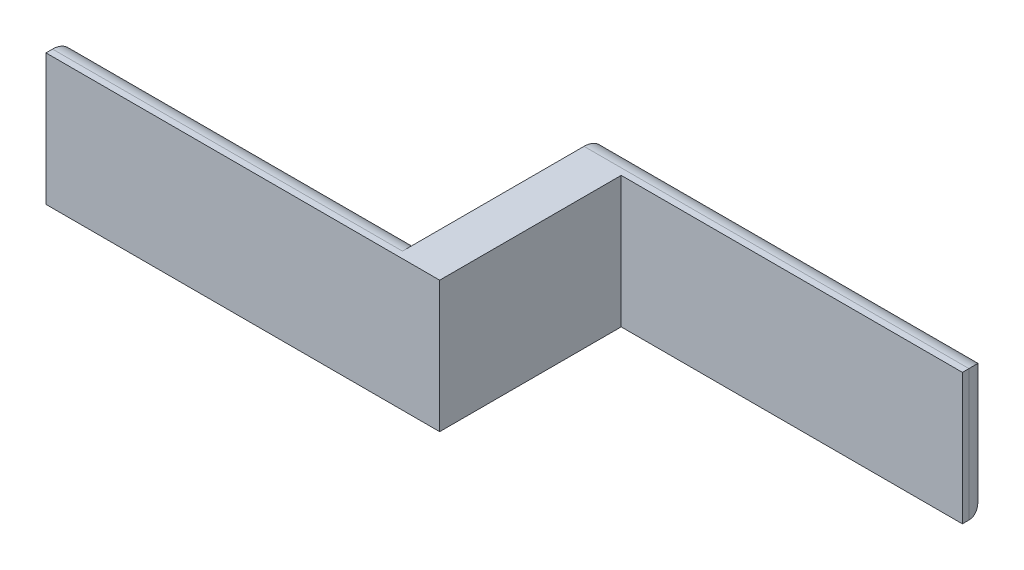
ISO-10303-21;
HEADER;
FILE_DESCRIPTION(('STEP AP214'),'2;1');
FILE_NAME('part.step','',(''),(''),'','','');
FILE_SCHEMA(('AUTOMOTIVE_DESIGN { 1 0 10303 214 1 1 1 1 }'));
ENDSEC;
DATA;
#1=APPLICATION_CONTEXT('core data for automotive mechanical design processes');
#2=APPLICATION_PROTOCOL_DEFINITION('international standard','automotive_design',2000,#1);
#3=PRODUCT_CONTEXT('',#1,'mechanical');
#4=PRODUCT('Part','Part','',(#3));
#5=PRODUCT_RELATED_PRODUCT_CATEGORY('part','',(#4));
#6=PRODUCT_DEFINITION_FORMATION('','',#4);
#7=PRODUCT_DEFINITION_CONTEXT('part definition',#1,'design');
#8=PRODUCT_DEFINITION('design','',#6,#7);
#9=PRODUCT_DEFINITION_SHAPE('','',#8);
#10=(LENGTH_UNIT() NAMED_UNIT(*) SI_UNIT(.MILLI.,.METRE.));
#11=(NAMED_UNIT(*) PLANE_ANGLE_UNIT() SI_UNIT($,.RADIAN.));
#12=(NAMED_UNIT(*) SI_UNIT($,.STERADIAN.) SOLID_ANGLE_UNIT());
#13=UNCERTAINTY_MEASURE_WITH_UNIT(LENGTH_MEASURE(1.E-05),#10,'distance_accuracy_value','');
#14=(GEOMETRIC_REPRESENTATION_CONTEXT(3) GLOBAL_UNCERTAINTY_ASSIGNED_CONTEXT((#13)) GLOBAL_UNIT_ASSIGNED_CONTEXT((#10,
#11,#12)) REPRESENTATION_CONTEXT('',''));
#15=CARTESIAN_POINT('',(0.,0.,0.));
#16=DIRECTION('',(0.,0.,1.));
#17=DIRECTION('',(1.,0.,0.));
#18=AXIS2_PLACEMENT_3D('',#15,#16,#17);
#19=CARTESIAN_POINT('',(0.,38.1,0.));
#20=DIRECTION('',(0.,0.,-1.));
#21=DIRECTION('',(-1.,0.,0.));
#22=AXIS2_PLACEMENT_3D('',#19,#20,#21);
#23=PLANE('',#22);
#24=DIRECTION('',(1.,0.,0.));
#25=VECTOR('',#24,1.);
#26=CARTESIAN_POINT('',(0.,0.,0.));
#27=LINE('',#26,#25);
#28=CARTESIAN_POINT('',(0.,0.,0.));
#29=VERTEX_POINT('',#28);
#30=CARTESIAN_POINT('',(114.3,0.,0.));
#31=VERTEX_POINT('',#30);
#32=EDGE_CURVE('E151',#29,#31,#27,.T.);
#33=ORIENTED_EDGE('',*,*,#32,.T.);
#34=DIRECTION('',(0.,-1.,0.));
#35=VECTOR('',#34,1.);
#36=CARTESIAN_POINT('',(114.3,38.1,0.));
#37=LINE('',#36,#35);
#38=CARTESIAN_POINT('',(114.3,38.1,0.));
#39=VERTEX_POINT('',#38);
#40=EDGE_CURVE('E133',#39,#31,#37,.T.);
#41=ORIENTED_EDGE('',*,*,#40,.F.);
#42=DIRECTION('',(1.,0.,0.));
#43=VECTOR('',#42,1.);
#44=CARTESIAN_POINT('',(0.,38.1,0.));
#45=LINE('',#44,#43);
#46=CARTESIAN_POINT('',(0.,38.1,0.));
#47=VERTEX_POINT('',#46);
#48=EDGE_CURVE('E140',#47,#39,#45,.T.);
#49=ORIENTED_EDGE('',*,*,#48,.F.);
#50=DIRECTION('',(0.,-1.,0.));
#51=VECTOR('',#50,1.);
#52=CARTESIAN_POINT('',(0.,38.1,0.));
#53=LINE('',#52,#51);
#54=EDGE_CURVE('E211',#47,#29,#53,.T.);
#55=ORIENTED_EDGE('',*,*,#54,.T.);
#56=EDGE_LOOP('',(#33,#41,#49,#55));
#57=FACE_BOUND('',#56,.T.);
#58=ADVANCED_FACE('F36',(#57),#23,.F.);
#59=CARTESIAN_POINT('',(114.3,38.1,5.76461955093832E-13));
#60=DIRECTION('',(-1.,0.,0.));
#61=DIRECTION('',(0.,0.,1.));
#62=AXIS2_PLACEMENT_3D('',#59,#60,#61);
#63=PLANE('',#62);
#64=DIRECTION('',(0.,0.,-1.));
#65=VECTOR('',#64,1.);
#66=CARTESIAN_POINT('',(114.3,0.,5.76461955093832E-13));
#67=LINE('',#66,#65);
#68=CARTESIAN_POINT('',(114.3,0.,-52.705));
#69=VERTEX_POINT('',#68);
#70=EDGE_CURVE('E196',#31,#69,#67,.T.);
#71=ORIENTED_EDGE('',*,*,#70,.T.);
#72=DIRECTION('',(0.,-1.,0.));
#73=VECTOR('',#72,1.);
#74=CARTESIAN_POINT('',(114.3,38.1,-52.705));
#75=LINE('',#74,#73);
#76=CARTESIAN_POINT('',(114.3,38.1,-52.705));
#77=VERTEX_POINT('',#76);
#78=EDGE_CURVE('E136',#77,#69,#75,.T.);
#79=ORIENTED_EDGE('',*,*,#78,.F.);
#80=DIRECTION('',(0.,0.,-1.));
#81=VECTOR('',#80,1.);
#82=CARTESIAN_POINT('',(114.3,38.1,5.76461955093832E-13));
#83=LINE('',#82,#81);
#84=EDGE_CURVE('E129',#39,#77,#83,.T.);
#85=ORIENTED_EDGE('',*,*,#84,.F.);
#86=ORIENTED_EDGE('',*,*,#40,.T.);
#87=EDGE_LOOP('',(#71,#79,#85,#86));
#88=FACE_BOUND('',#87,.T.);
#89=ADVANCED_FACE('F131',(#88),#63,.F.);
#90=CARTESIAN_POINT('',(0.,38.1,-52.705));
#91=DIRECTION('',(0.,0.,-1.));
#92=DIRECTION('',(-1.,0.,0.));
#93=AXIS2_PLACEMENT_3D('',#90,#91,#92);
#94=PLANE('',#93);
#95=DIRECTION('',(1.,0.,0.));
#96=VECTOR('',#95,1.);
#97=CARTESIAN_POINT('',(0.,0.,-52.705));
#98=LINE('',#97,#96);
#99=CARTESIAN_POINT('',(213.36,0.,-52.705));
#100=VERTEX_POINT('',#99);
#101=EDGE_CURVE('E198',#69,#100,#98,.T.);
#102=ORIENTED_EDGE('',*,*,#101,.T.);
#103=DIRECTION('',(0.,-1.,0.));
#104=VECTOR('',#103,1.);
#105=CARTESIAN_POINT('',(213.36,38.1,-52.705));
#106=LINE('',#105,#104);
#107=CARTESIAN_POINT('',(213.36,38.1,-52.705));
#108=VERTEX_POINT('',#107);
#109=EDGE_CURVE('E156',#108,#100,#106,.T.);
#110=ORIENTED_EDGE('',*,*,#109,.F.);
#111=DIRECTION('',(1.,0.,0.));
#112=VECTOR('',#111,1.);
#113=CARTESIAN_POINT('',(0.,38.1,-52.705));
#114=LINE('',#113,#112);
#115=EDGE_CURVE('E139',#77,#108,#114,.T.);
#116=ORIENTED_EDGE('',*,*,#115,.F.);
#117=ORIENTED_EDGE('',*,*,#78,.T.);
#118=EDGE_LOOP('',(#102,#110,#116,#117));
#119=FACE_BOUND('',#118,.T.);
#120=ADVANCED_FACE('F255',(#119),#94,.F.);
#121=CARTESIAN_POINT('',(213.36,38.1,1.4347497549002E-12));
#122=DIRECTION('',(-1.,0.,0.));
#123=DIRECTION('',(0.,0.,1.));
#124=AXIS2_PLACEMENT_3D('',#121,#122,#123);
#125=PLANE('',#124);
#126=DIRECTION('',(0.,0.,-1.));
#127=VECTOR('',#126,1.);
#128=CARTESIAN_POINT('',(213.36,0.,1.4347497549002E-12));
#129=LINE('',#128,#127);
#130=CARTESIAN_POINT('',(213.36,0.,-54.61));
#131=VERTEX_POINT('',#130);
#132=EDGE_CURVE('E204',#100,#131,#129,.T.);
#133=ORIENTED_EDGE('',*,*,#132,.T.);
#134=DIRECTION('',(0.,-1.,0.));
#135=VECTOR('',#134,1.);
#136=CARTESIAN_POINT('',(213.36,38.1,-54.6099999999999));
#137=LINE('',#136,#135);
#138=CARTESIAN_POINT('',(213.36,38.1,-54.6099999999999));
#139=VERTEX_POINT('',#138);
#140=EDGE_CURVE('E184',#131,#139,#137,.F.);
#141=ORIENTED_EDGE('',*,*,#140,.T.);
#142=DIRECTION('',(0.,0.,-1.));
#143=VECTOR('',#142,1.);
#144=CARTESIAN_POINT('',(213.36,38.1,1.4347497549002E-12));
#145=LINE('',#144,#143);
#146=EDGE_CURVE('E225',#108,#139,#145,.T.);
#147=ORIENTED_EDGE('',*,*,#146,.F.);
#148=ORIENTED_EDGE('',*,*,#109,.T.);
#149=EDGE_LOOP('',(#133,#141,#147,#148));
#150=FACE_BOUND('',#149,.T.);
#151=ADVANCED_FACE('F224',(#150),#125,.F.);
#152=CARTESIAN_POINT('',(0.,38.1,-60.96));
#153=DIRECTION('',(0.,0.,-1.));
#154=DIRECTION('',(-1.,0.,0.));
#155=AXIS2_PLACEMENT_3D('',#152,#153,#154);
#156=PLANE('',#155);
#157=DIRECTION('',(0.,-1.,0.));
#158=VECTOR('',#157,1.);
#159=CARTESIAN_POINT('',(101.6,38.1,-60.96));
#160=LINE('',#159,#158);
#161=CARTESIAN_POINT('',(101.6,31.75,-60.96));
#162=VERTEX_POINT('',#161);
#163=CARTESIAN_POINT('',(101.6,6.35000000000002,-60.96));
#164=VERTEX_POINT('',#163);
#165=EDGE_CURVE('E217',#162,#164,#160,.T.);
#166=ORIENTED_EDGE('',*,*,#165,.F.);
#167=DIRECTION('',(1.,0.,0.));
#168=VECTOR('',#167,1.);
#169=CARTESIAN_POINT('',(0.,31.75,-60.96));
#170=LINE('',#169,#168);
#171=CARTESIAN_POINT('',(207.01,31.75,-60.96));
#172=VERTEX_POINT('',#171);
#173=EDGE_CURVE('E161',#162,#172,#170,.T.);
#174=ORIENTED_EDGE('',*,*,#173,.T.);
#175=DIRECTION('',(0.,-1.,0.));
#176=VECTOR('',#175,1.);
#177=CARTESIAN_POINT('',(207.01,0.,-60.96));
#178=LINE('',#177,#176);
#179=CARTESIAN_POINT('',(207.01,6.35,-60.96));
#180=VERTEX_POINT('',#179);
#181=EDGE_CURVE('E154',#172,#180,#178,.T.);
#182=ORIENTED_EDGE('',*,*,#181,.T.);
#183=DIRECTION('',(1.,0.,0.));
#184=VECTOR('',#183,1.);
#185=CARTESIAN_POINT('',(101.6,6.35,-60.96));
#186=LINE('',#185,#184);
#187=EDGE_CURVE('E152',#180,#164,#186,.F.);
#188=ORIENTED_EDGE('',*,*,#187,.T.);
#189=EDGE_LOOP('',(#166,#174,#182,#188));
#190=FACE_BOUND('',#189,.T.);
#191=ADVANCED_FACE('F246',(#190),#156,.T.);
#192=CARTESIAN_POINT('',(101.6,38.1,0.));
#193=DIRECTION('',(1.,0.,0.));
#194=DIRECTION('',(0.,0.,-1.));
#195=AXIS2_PLACEMENT_3D('',#192,#193,#194);
#196=PLANE('',#195);
#197=DIRECTION('',(0.,0.,1.));
#198=VECTOR('',#197,1.);
#199=CARTESIAN_POINT('',(101.6,38.1,0.));
#200=LINE('',#199,#198);
#201=CARTESIAN_POINT('',(101.6,38.1,-54.61));
#202=VERTEX_POINT('',#201);
#203=CARTESIAN_POINT('',(101.6,38.1,-1.90499999999999));
#204=VERTEX_POINT('',#203);
#205=EDGE_CURVE('E238',#202,#204,#200,.T.);
#206=ORIENTED_EDGE('',*,*,#205,.F.);
#207=CARTESIAN_POINT('',(101.6,31.75,-54.61));
#208=DIRECTION('',(1.,0.,0.));
#209=DIRECTION('',(0.,0.,-1.));
#210=AXIS2_PLACEMENT_3D('',#207,#208,#209);
#211=CIRCLE('',#210,6.35);
#212=EDGE_CURVE('E170',#202,#162,#211,.F.);
#213=ORIENTED_EDGE('',*,*,#212,.T.);
#214=ORIENTED_EDGE('',*,*,#165,.T.);
#215=CARTESIAN_POINT('',(101.6,6.35,-54.61));
#216=DIRECTION('',(1.,0.,0.));
#217=DIRECTION('',(0.,0.,-1.));
#218=AXIS2_PLACEMENT_3D('',#215,#216,#217);
#219=CIRCLE('',#218,6.35);
#220=CARTESIAN_POINT('',(101.6,0.,-54.61));
#221=VERTEX_POINT('',#220);
#222=EDGE_CURVE('E168',#164,#221,#219,.F.);
#223=ORIENTED_EDGE('',*,*,#222,.T.);
#224=DIRECTION('',(0.,0.,1.));
#225=VECTOR('',#224,1.);
#226=CARTESIAN_POINT('',(101.6,0.,0.));
#227=LINE('',#226,#225);
#228=CARTESIAN_POINT('',(101.6,0.,-1.90499999999999));
#229=VERTEX_POINT('',#228);
#230=EDGE_CURVE('E207',#221,#229,#227,.T.);
#231=ORIENTED_EDGE('',*,*,#230,.T.);
#232=CARTESIAN_POINT('',(101.6,6.35,-1.90499999999999));
#233=DIRECTION('',(1.,0.,0.));
#234=DIRECTION('',(0.,0.,-1.));
#235=AXIS2_PLACEMENT_3D('',#232,#233,#234);
#236=CIRCLE('',#235,6.35);
#237=CARTESIAN_POINT('',(101.6,6.35000000000002,-8.25499999999999));
#238=VERTEX_POINT('',#237);
#239=EDGE_CURVE('E45',#229,#238,#236,.T.);
#240=ORIENTED_EDGE('',*,*,#239,.T.);
#241=DIRECTION('',(0.,-1.,0.));
#242=VECTOR('',#241,1.);
#243=CARTESIAN_POINT('',(101.6,38.1,-8.25499999999999));
#244=LINE('',#243,#242);
#245=CARTESIAN_POINT('',(101.6,31.75,-8.25499999999999));
#246=VERTEX_POINT('',#245);
#247=EDGE_CURVE('E215',#246,#238,#244,.T.);
#248=ORIENTED_EDGE('',*,*,#247,.F.);
#249=CARTESIAN_POINT('',(101.6,31.75,-1.90499999999999));
#250=DIRECTION('',(1.,0.,0.));
#251=DIRECTION('',(0.,0.,-1.));
#252=AXIS2_PLACEMENT_3D('',#249,#250,#251);
#253=CIRCLE('',#252,6.35);
#254=EDGE_CURVE('E11',#246,#204,#253,.T.);
#255=ORIENTED_EDGE('',*,*,#254,.T.);
#256=EDGE_LOOP('',(#206,#213,#214,#223,#231,#240,#248,#255));
#257=FACE_BOUND('',#256,.T.);
#258=ADVANCED_FACE('F244',(#257),#196,.F.);
#259=CARTESIAN_POINT('',(0.,38.1,-8.255));
#260=DIRECTION('',(0.,0.,-1.));
#261=DIRECTION('',(-1.,0.,0.));
#262=AXIS2_PLACEMENT_3D('',#259,#260,#261);
#263=PLANE('',#262);
#264=ORIENTED_EDGE('',*,*,#247,.T.);
#265=DIRECTION('',(1.,0.,0.));
#266=VECTOR('',#265,1.);
#267=CARTESIAN_POINT('',(0.,6.35,-8.25499999999999));
#268=LINE('',#267,#266);
#269=CARTESIAN_POINT('',(0.,6.35000000000002,-8.255));
#270=VERTEX_POINT('',#269);
#271=EDGE_CURVE('E53',#238,#270,#268,.F.);
#272=ORIENTED_EDGE('',*,*,#271,.T.);
#273=DIRECTION('',(0.,-1.,0.));
#274=VECTOR('',#273,1.);
#275=CARTESIAN_POINT('',(0.,38.1,-8.255));
#276=LINE('',#275,#274);
#277=CARTESIAN_POINT('',(0.,31.75,-8.255));
#278=VERTEX_POINT('',#277);
#279=EDGE_CURVE('E213',#278,#270,#276,.T.);
#280=ORIENTED_EDGE('',*,*,#279,.F.);
#281=DIRECTION('',(1.,0.,0.));
#282=VECTOR('',#281,1.);
#283=CARTESIAN_POINT('',(0.,31.75,-8.255));
#284=LINE('',#283,#282);
#285=EDGE_CURVE('E177',#278,#246,#284,.T.);
#286=ORIENTED_EDGE('',*,*,#285,.T.);
#287=EDGE_LOOP('',(#264,#272,#280,#286));
#288=FACE_BOUND('',#287,.T.);
#289=ADVANCED_FACE('F253',(#288),#263,.T.);
#290=CARTESIAN_POINT('',(0.,38.1,0.));
#291=DIRECTION('',(-1.,0.,0.));
#292=DIRECTION('',(0.,0.,1.));
#293=AXIS2_PLACEMENT_3D('',#290,#291,#292);
#294=PLANE('',#293);
#295=ORIENTED_EDGE('',*,*,#279,.T.);
#296=CARTESIAN_POINT('',(0.,6.35,-1.905));
#297=DIRECTION('',(-1.,0.,0.));
#298=DIRECTION('',(0.,0.,1.));
#299=AXIS2_PLACEMENT_3D('',#296,#297,#298);
#300=CIRCLE('',#299,6.35);
#301=CARTESIAN_POINT('',(0.,0.,-1.905));
#302=VERTEX_POINT('',#301);
#303=EDGE_CURVE('E182',#270,#302,#300,.T.);
#304=ORIENTED_EDGE('',*,*,#303,.T.);
#305=DIRECTION('',(0.,0.,-1.));
#306=VECTOR('',#305,1.);
#307=CARTESIAN_POINT('',(0.,0.,0.));
#308=LINE('',#307,#306);
#309=EDGE_CURVE('E148',#29,#302,#308,.T.);
#310=ORIENTED_EDGE('',*,*,#309,.F.);
#311=ORIENTED_EDGE('',*,*,#54,.F.);
#312=DIRECTION('',(0.,0.,-1.));
#313=VECTOR('',#312,1.);
#314=CARTESIAN_POINT('',(0.,38.1,0.));
#315=LINE('',#314,#313);
#316=CARTESIAN_POINT('',(0.,38.1,-1.905));
#317=VERTEX_POINT('',#316);
#318=EDGE_CURVE('E146',#47,#317,#315,.T.);
#319=ORIENTED_EDGE('',*,*,#318,.T.);
#320=CARTESIAN_POINT('',(0.,31.75,-1.905));
#321=DIRECTION('',(-1.,0.,0.));
#322=DIRECTION('',(0.,0.,1.));
#323=AXIS2_PLACEMENT_3D('',#320,#321,#322);
#324=CIRCLE('',#323,6.35);
#325=EDGE_CURVE('E60',#317,#278,#324,.T.);
#326=ORIENTED_EDGE('',*,*,#325,.T.);
#327=EDGE_LOOP('',(#295,#304,#310,#311,#319,#326));
#328=FACE_BOUND('',#327,.T.);
#329=ADVANCED_FACE('F281',(#328),#294,.T.);
#330=CARTESIAN_POINT('',(0.,38.1,0.));
#331=DIRECTION('',(0.,1.,0.));
#332=DIRECTION('',(0.,0.,1.));
#333=AXIS2_PLACEMENT_3D('',#330,#331,#332);
#334=PLANE('',#333);
#335=ORIENTED_EDGE('',*,*,#146,.T.);
#336=DIRECTION('',(1.,0.,0.));
#337=VECTOR('',#336,1.);
#338=CARTESIAN_POINT('',(0.,38.1,-54.61));
#339=LINE('',#338,#337);
#340=EDGE_CURVE('E166',#139,#202,#339,.F.);
#341=ORIENTED_EDGE('',*,*,#340,.T.);
#342=ORIENTED_EDGE('',*,*,#205,.T.);
#343=DIRECTION('',(1.,0.,0.));
#344=VECTOR('',#343,1.);
#345=CARTESIAN_POINT('',(0.,38.1,-1.905));
#346=LINE('',#345,#344);
#347=EDGE_CURVE('E164',#204,#317,#346,.F.);
#348=ORIENTED_EDGE('',*,*,#347,.T.);
#349=ORIENTED_EDGE('',*,*,#318,.F.);
#350=ORIENTED_EDGE('',*,*,#48,.T.);
#351=ORIENTED_EDGE('',*,*,#84,.T.);
#352=ORIENTED_EDGE('',*,*,#115,.T.);
#353=EDGE_LOOP('',(#335,#341,#342,#348,#349,#350,#351,#352));
#354=FACE_BOUND('',#353,.T.);
#355=ADVANCED_FACE('F145',(#354),#334,.T.);
#356=CARTESIAN_POINT('',(0.,0.,0.));
#357=DIRECTION('',(0.,1.,0.));
#358=DIRECTION('',(0.,0.,1.));
#359=AXIS2_PLACEMENT_3D('',#356,#357,#358);
#360=PLANE('',#359);
#361=ORIENTED_EDGE('',*,*,#309,.T.);
#362=DIRECTION('',(1.,0.,0.));
#363=VECTOR('',#362,1.);
#364=CARTESIAN_POINT('',(101.6,0.,-1.90499999999999));
#365=LINE('',#364,#363);
#366=EDGE_CURVE('E174',#302,#229,#365,.T.);
#367=ORIENTED_EDGE('',*,*,#366,.T.);
#368=ORIENTED_EDGE('',*,*,#230,.F.);
#369=DIRECTION('',(1.,0.,0.));
#370=VECTOR('',#369,1.);
#371=CARTESIAN_POINT('',(213.36,0.,-54.61));
#372=LINE('',#371,#370);
#373=EDGE_CURVE('E172',#221,#131,#372,.T.);
#374=ORIENTED_EDGE('',*,*,#373,.T.);
#375=ORIENTED_EDGE('',*,*,#132,.F.);
#376=ORIENTED_EDGE('',*,*,#101,.F.);
#377=ORIENTED_EDGE('',*,*,#70,.F.);
#378=ORIENTED_EDGE('',*,*,#32,.F.);
#379=EDGE_LOOP('',(#361,#367,#368,#374,#375,#376,#377,#378));
#380=FACE_BOUND('',#379,.T.);
#381=ADVANCED_FACE('F229',(#380),#360,.F.);
#382=CARTESIAN_POINT('',(0.,6.35,-54.61));
#383=DIRECTION('',(-1.,0.,0.));
#384=DIRECTION('',(0.,0.,1.));
#385=AXIS2_PLACEMENT_3D('',#382,#383,#384);
#386=CYLINDRICAL_SURFACE('',#385,6.35);
#387=ORIENTED_EDGE('',*,*,#222,.F.);
#388=ORIENTED_EDGE('',*,*,#187,.F.);
#389=CARTESIAN_POINT('',(207.01,6.35,-54.61));
#390=DIRECTION('',(-0.707106781186547,-0.707106781186547,0.));
#391=DIRECTION('',(-0.707106781186547,0.707106781186547,0.));
#392=AXIS2_PLACEMENT_3D('',#389,#390,#391);
#393=ELLIPSE('',#392,8.98025612106915,6.35);
#394=EDGE_CURVE('E40',#131,#180,#393,.F.);
#395=ORIENTED_EDGE('',*,*,#394,.F.);
#396=ORIENTED_EDGE('',*,*,#373,.F.);
#397=EDGE_LOOP('',(#387,#388,#395,#396));
#398=FACE_BOUND('',#397,.T.);
#399=ADVANCED_FACE('F234',(#398),#386,.T.);
#400=CARTESIAN_POINT('',(207.01,38.1,-54.61));
#401=DIRECTION('',(0.,1.,0.));
#402=DIRECTION('',(0.,0.,1.));
#403=AXIS2_PLACEMENT_3D('',#400,#401,#402);
#404=CYLINDRICAL_SURFACE('',#403,6.35);
#405=ORIENTED_EDGE('',*,*,#394,.T.);
#406=ORIENTED_EDGE('',*,*,#181,.F.);
#407=CARTESIAN_POINT('',(207.01,31.75,-54.61));
#408=DIRECTION('',(-0.707106781186547,0.707106781186547,0.));
#409=DIRECTION('',(0.707106781186547,0.707106781186547,0.));
#410=AXIS2_PLACEMENT_3D('',#407,#408,#409);
#411=ELLIPSE('',#410,8.98025612106915,6.35);
#412=EDGE_CURVE('E186',#139,#172,#411,.T.);
#413=ORIENTED_EDGE('',*,*,#412,.F.);
#414=ORIENTED_EDGE('',*,*,#140,.F.);
#415=EDGE_LOOP('',(#405,#406,#413,#414));
#416=FACE_BOUND('',#415,.T.);
#417=ADVANCED_FACE('F236',(#416),#404,.T.);
#418=CARTESIAN_POINT('',(0.,31.75,-54.61));
#419=DIRECTION('',(1.,0.,0.));
#420=DIRECTION('',(0.,0.,-1.));
#421=AXIS2_PLACEMENT_3D('',#418,#419,#420);
#422=CYLINDRICAL_SURFACE('',#421,6.35);
#423=ORIENTED_EDGE('',*,*,#212,.F.);
#424=ORIENTED_EDGE('',*,*,#340,.F.);
#425=ORIENTED_EDGE('',*,*,#412,.T.);
#426=ORIENTED_EDGE('',*,*,#173,.F.);
#427=EDGE_LOOP('',(#423,#424,#425,#426));
#428=FACE_BOUND('',#427,.T.);
#429=ADVANCED_FACE('F241',(#428),#422,.T.);
#430=CARTESIAN_POINT('',(0.,6.35,-1.905));
#431=DIRECTION('',(-1.,0.,0.));
#432=DIRECTION('',(0.,0.,1.));
#433=AXIS2_PLACEMENT_3D('',#430,#431,#432);
#434=CYLINDRICAL_SURFACE('',#433,6.35);
#435=ORIENTED_EDGE('',*,*,#303,.F.);
#436=ORIENTED_EDGE('',*,*,#271,.F.);
#437=ORIENTED_EDGE('',*,*,#239,.F.);
#438=ORIENTED_EDGE('',*,*,#366,.F.);
#439=EDGE_LOOP('',(#435,#436,#437,#438));
#440=FACE_BOUND('',#439,.T.);
#441=ADVANCED_FACE('F267',(#440),#434,.T.);
#442=CARTESIAN_POINT('',(0.,31.75,-1.905));
#443=DIRECTION('',(1.,0.,0.));
#444=DIRECTION('',(0.,0.,-1.));
#445=AXIS2_PLACEMENT_3D('',#442,#443,#444);
#446=CYLINDRICAL_SURFACE('',#445,6.35);
#447=ORIENTED_EDGE('',*,*,#325,.F.);
#448=ORIENTED_EDGE('',*,*,#347,.F.);
#449=ORIENTED_EDGE('',*,*,#254,.F.);
#450=ORIENTED_EDGE('',*,*,#285,.F.);
#451=EDGE_LOOP('',(#447,#448,#449,#450));
#452=FACE_BOUND('',#451,.T.);
#453=ADVANCED_FACE('F38',(#452),#446,.T.);
#454=CLOSED_SHELL('',(#58,#89,#120,#151,#191,#258,#289,#329,#355,#381,#399,#417,#429,#441,#453));
#455=MANIFOLD_SOLID_BREP('B2',#454);
#456=ADVANCED_BREP_SHAPE_REPRESENTATION('',(#18,#455),#14);
#457=SHAPE_DEFINITION_REPRESENTATION(#9,#456);
ENDSEC;
END-ISO-10303-21;
